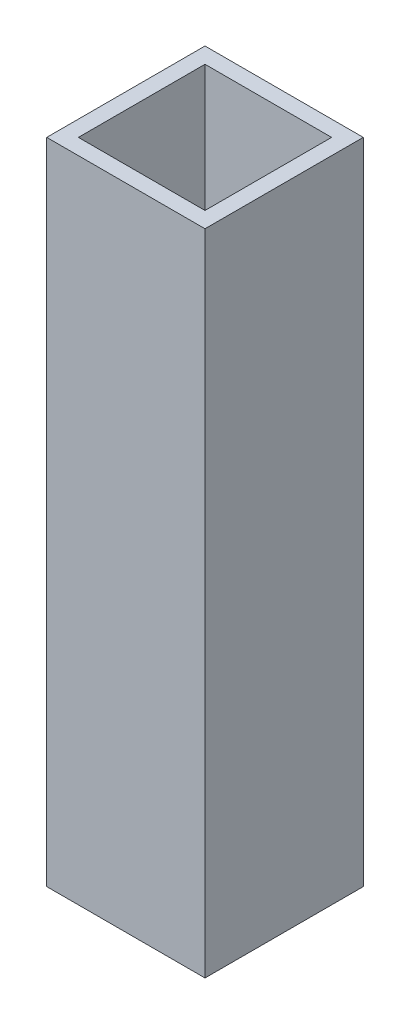
ISO-10303-21;
HEADER;
FILE_DESCRIPTION(('STEP AP214'),'2;1');
FILE_NAME('part.step','',(''),(''),'','','');
FILE_SCHEMA(('AUTOMOTIVE_DESIGN { 1 0 10303 214 1 1 1 1 }'));
ENDSEC;
DATA;
#1=APPLICATION_CONTEXT('core data for automotive mechanical design processes');
#2=APPLICATION_PROTOCOL_DEFINITION('international standard','automotive_design',2000,#1);
#3=PRODUCT_CONTEXT('',#1,'mechanical');
#4=PRODUCT('Part','Part','',(#3));
#5=PRODUCT_RELATED_PRODUCT_CATEGORY('part','',(#4));
#6=PRODUCT_DEFINITION_FORMATION('','',#4);
#7=PRODUCT_DEFINITION_CONTEXT('part definition',#1,'design');
#8=PRODUCT_DEFINITION('design','',#6,#7);
#9=PRODUCT_DEFINITION_SHAPE('','',#8);
#10=(LENGTH_UNIT() NAMED_UNIT(*) SI_UNIT(.MILLI.,.METRE.));
#11=(NAMED_UNIT(*) PLANE_ANGLE_UNIT() SI_UNIT($,.RADIAN.));
#12=(NAMED_UNIT(*) SI_UNIT($,.STERADIAN.) SOLID_ANGLE_UNIT());
#13=UNCERTAINTY_MEASURE_WITH_UNIT(LENGTH_MEASURE(1.E-05),#10,'distance_accuracy_value','');
#14=(GEOMETRIC_REPRESENTATION_CONTEXT(3) GLOBAL_UNCERTAINTY_ASSIGNED_CONTEXT((#13)) GLOBAL_UNIT_ASSIGNED_CONTEXT((#10,
#11,#12)) REPRESENTATION_CONTEXT('',''));
#15=CARTESIAN_POINT('',(0.,0.,0.));
#16=DIRECTION('',(0.,0.,1.));
#17=DIRECTION('',(1.,0.,0.));
#18=AXIS2_PLACEMENT_3D('',#15,#16,#17);
#19=CARTESIAN_POINT('',(0.,205.,0.));
#20=DIRECTION('',(0.,1.,0.));
#21=DIRECTION('',(0.,0.,1.));
#22=AXIS2_PLACEMENT_3D('',#19,#20,#21);
#23=PLANE('',#22);
#24=DIRECTION('',(0.,0.,1.));
#25=VECTOR('',#24,1.);
#26=CARTESIAN_POINT('',(-25.,205.,-25.));
#27=LINE('',#26,#25);
#28=CARTESIAN_POINT('',(-25.,205.,-25.));
#29=VERTEX_POINT('',#28);
#30=CARTESIAN_POINT('',(-25.,205.,25.));
#31=VERTEX_POINT('',#30);
#32=EDGE_CURVE('E153',#29,#31,#27,.T.);
#33=ORIENTED_EDGE('',*,*,#32,.T.);
#34=DIRECTION('',(1.,0.,0.));
#35=VECTOR('',#34,1.);
#36=CARTESIAN_POINT('',(-25.,205.,25.));
#37=LINE('',#36,#35);
#38=CARTESIAN_POINT('',(25.,205.,25.));
#39=VERTEX_POINT('',#38);
#40=EDGE_CURVE('E157',#31,#39,#37,.T.);
#41=ORIENTED_EDGE('',*,*,#40,.T.);
#42=DIRECTION('',(0.,0.,-1.));
#43=VECTOR('',#42,1.);
#44=CARTESIAN_POINT('',(25.,205.,-25.));
#45=LINE('',#44,#43);
#46=CARTESIAN_POINT('',(25.,205.,-25.));
#47=VERTEX_POINT('',#46);
#48=EDGE_CURVE('E161',#39,#47,#45,.T.);
#49=ORIENTED_EDGE('',*,*,#48,.T.);
#50=DIRECTION('',(-1.,0.,0.));
#51=VECTOR('',#50,1.);
#52=CARTESIAN_POINT('',(-25.,205.,-25.));
#53=LINE('',#52,#51);
#54=EDGE_CURVE('E164',#47,#29,#53,.T.);
#55=ORIENTED_EDGE('',*,*,#54,.T.);
#56=EDGE_LOOP('',(#33,#41,#49,#55));
#57=FACE_BOUND('',#56,.T.);
#58=DIRECTION('',(-1.,0.,0.));
#59=VECTOR('',#58,1.);
#60=CARTESIAN_POINT('',(-20.,205.,-20.));
#61=LINE('',#60,#59);
#62=CARTESIAN_POINT('',(20.,205.,-20.));
#63=VERTEX_POINT('',#62);
#64=CARTESIAN_POINT('',(-20.,205.,-20.));
#65=VERTEX_POINT('',#64);
#66=EDGE_CURVE('E114',#63,#65,#61,.T.);
#67=ORIENTED_EDGE('',*,*,#66,.F.);
#68=DIRECTION('',(0.,0.,-1.));
#69=VECTOR('',#68,1.);
#70=CARTESIAN_POINT('',(20.,205.,-20.));
#71=LINE('',#70,#69);
#72=CARTESIAN_POINT('',(20.,205.,20.));
#73=VERTEX_POINT('',#72);
#74=EDGE_CURVE('E105',#73,#63,#71,.T.);
#75=ORIENTED_EDGE('',*,*,#74,.F.);
#76=DIRECTION('',(1.,0.,0.));
#77=VECTOR('',#76,1.);
#78=CARTESIAN_POINT('',(-20.,205.,20.));
#79=LINE('',#78,#77);
#80=CARTESIAN_POINT('',(-20.,205.,20.));
#81=VERTEX_POINT('',#80);
#82=EDGE_CURVE('E131',#81,#73,#79,.T.);
#83=ORIENTED_EDGE('',*,*,#82,.F.);
#84=DIRECTION('',(0.,0.,1.));
#85=VECTOR('',#84,1.);
#86=CARTESIAN_POINT('',(-20.,205.,-20.));
#87=LINE('',#86,#85);
#88=EDGE_CURVE('E127',#65,#81,#87,.T.);
#89=ORIENTED_EDGE('',*,*,#88,.F.);
#90=EDGE_LOOP('',(#67,#75,#83,#89));
#91=FACE_BOUND('',#90,.T.);
#92=ADVANCED_FACE('F39',(#57,#91),#23,.T.);
#93=CARTESIAN_POINT('',(0.,0.,0.));
#94=DIRECTION('',(0.,1.,0.));
#95=DIRECTION('',(0.,0.,1.));
#96=AXIS2_PLACEMENT_3D('',#93,#94,#95);
#97=PLANE('',#96);
#98=DIRECTION('',(0.,0.,1.));
#99=VECTOR('',#98,1.);
#100=CARTESIAN_POINT('',(-25.,0.,-25.));
#101=LINE('',#100,#99);
#102=CARTESIAN_POINT('',(-25.,0.,-25.));
#103=VERTEX_POINT('',#102);
#104=CARTESIAN_POINT('',(-25.,0.,25.));
#105=VERTEX_POINT('',#104);
#106=EDGE_CURVE('E123',#103,#105,#101,.T.);
#107=ORIENTED_EDGE('',*,*,#106,.F.);
#108=DIRECTION('',(-1.,0.,0.));
#109=VECTOR('',#108,1.);
#110=CARTESIAN_POINT('',(-25.,0.,-25.));
#111=LINE('',#110,#109);
#112=CARTESIAN_POINT('',(25.,0.,-25.));
#113=VERTEX_POINT('',#112);
#114=EDGE_CURVE('E158',#113,#103,#111,.T.);
#115=ORIENTED_EDGE('',*,*,#114,.F.);
#116=DIRECTION('',(0.,0.,-1.));
#117=VECTOR('',#116,1.);
#118=CARTESIAN_POINT('',(25.,0.,-25.));
#119=LINE('',#118,#117);
#120=CARTESIAN_POINT('',(25.,0.,25.));
#121=VERTEX_POINT('',#120);
#122=EDGE_CURVE('E174',#121,#113,#119,.T.);
#123=ORIENTED_EDGE('',*,*,#122,.F.);
#124=DIRECTION('',(1.,0.,0.));
#125=VECTOR('',#124,1.);
#126=CARTESIAN_POINT('',(-25.,0.,25.));
#127=LINE('',#126,#125);
#128=EDGE_CURVE('E171',#105,#121,#127,.T.);
#129=ORIENTED_EDGE('',*,*,#128,.F.);
#130=EDGE_LOOP('',(#107,#115,#123,#129));
#131=FACE_BOUND('',#130,.T.);
#132=DIRECTION('',(0.,0.,-1.));
#133=VECTOR('',#132,1.);
#134=CARTESIAN_POINT('',(20.,0.,-20.));
#135=LINE('',#134,#133);
#136=CARTESIAN_POINT('',(20.,0.,20.));
#137=VERTEX_POINT('',#136);
#138=CARTESIAN_POINT('',(20.,0.,-20.));
#139=VERTEX_POINT('',#138);
#140=EDGE_CURVE('E63',#137,#139,#135,.T.);
#141=ORIENTED_EDGE('',*,*,#140,.T.);
#142=DIRECTION('',(-1.,0.,0.));
#143=VECTOR('',#142,1.);
#144=CARTESIAN_POINT('',(-20.,0.,-20.));
#145=LINE('',#144,#143);
#146=CARTESIAN_POINT('',(-20.,0.,-20.));
#147=VERTEX_POINT('',#146);
#148=EDGE_CURVE('E121',#139,#147,#145,.T.);
#149=ORIENTED_EDGE('',*,*,#148,.T.);
#150=DIRECTION('',(0.,0.,1.));
#151=VECTOR('',#150,1.);
#152=CARTESIAN_POINT('',(-20.,0.,-20.));
#153=LINE('',#152,#151);
#154=CARTESIAN_POINT('',(-20.,0.,20.));
#155=VERTEX_POINT('',#154);
#156=EDGE_CURVE('E140',#147,#155,#153,.T.);
#157=ORIENTED_EDGE('',*,*,#156,.T.);
#158=DIRECTION('',(1.,0.,0.));
#159=VECTOR('',#158,1.);
#160=CARTESIAN_POINT('',(-20.,0.,20.));
#161=LINE('',#160,#159);
#162=EDGE_CURVE('E115',#155,#137,#161,.T.);
#163=ORIENTED_EDGE('',*,*,#162,.T.);
#164=EDGE_LOOP('',(#141,#149,#157,#163));
#165=FACE_BOUND('',#164,.T.);
#166=ADVANCED_FACE('F197',(#131,#165),#97,.F.);
#167=CARTESIAN_POINT('',(-25.,205.,-25.));
#168=DIRECTION('',(1.,0.,0.));
#169=DIRECTION('',(0.,0.,-1.));
#170=AXIS2_PLACEMENT_3D('',#167,#168,#169);
#171=PLANE('',#170);
#172=ORIENTED_EDGE('',*,*,#106,.T.);
#173=DIRECTION('',(0.,-1.,0.));
#174=VECTOR('',#173,1.);
#175=CARTESIAN_POINT('',(-25.,205.,25.));
#176=LINE('',#175,#174);
#177=EDGE_CURVE('E11',#31,#105,#176,.T.);
#178=ORIENTED_EDGE('',*,*,#177,.F.);
#179=ORIENTED_EDGE('',*,*,#32,.F.);
#180=DIRECTION('',(0.,-1.,0.));
#181=VECTOR('',#180,1.);
#182=CARTESIAN_POINT('',(-25.,205.,-25.));
#183=LINE('',#182,#181);
#184=EDGE_CURVE('E167',#29,#103,#183,.T.);
#185=ORIENTED_EDGE('',*,*,#184,.T.);
#186=EDGE_LOOP('',(#172,#178,#179,#185));
#187=FACE_BOUND('',#186,.T.);
#188=ADVANCED_FACE('F41',(#187),#171,.F.);
#189=CARTESIAN_POINT('',(-25.,205.,25.));
#190=DIRECTION('',(0.,0.,-1.));
#191=DIRECTION('',(-1.,0.,0.));
#192=AXIS2_PLACEMENT_3D('',#189,#190,#191);
#193=PLANE('',#192);
#194=ORIENTED_EDGE('',*,*,#128,.T.);
#195=DIRECTION('',(0.,-1.,0.));
#196=VECTOR('',#195,1.);
#197=CARTESIAN_POINT('',(25.,205.,25.));
#198=LINE('',#197,#196);
#199=EDGE_CURVE('E48',#39,#121,#198,.T.);
#200=ORIENTED_EDGE('',*,*,#199,.F.);
#201=ORIENTED_EDGE('',*,*,#40,.F.);
#202=ORIENTED_EDGE('',*,*,#177,.T.);
#203=EDGE_LOOP('',(#194,#200,#201,#202));
#204=FACE_BOUND('',#203,.T.);
#205=ADVANCED_FACE('F207',(#204),#193,.F.);
#206=CARTESIAN_POINT('',(25.,205.,-25.));
#207=DIRECTION('',(-1.,0.,0.));
#208=DIRECTION('',(0.,0.,1.));
#209=AXIS2_PLACEMENT_3D('',#206,#207,#208);
#210=PLANE('',#209);
#211=ORIENTED_EDGE('',*,*,#122,.T.);
#212=DIRECTION('',(0.,-1.,0.));
#213=VECTOR('',#212,1.);
#214=CARTESIAN_POINT('',(25.,205.,-25.));
#215=LINE('',#214,#213);
#216=EDGE_CURVE('E182',#47,#113,#215,.T.);
#217=ORIENTED_EDGE('',*,*,#216,.F.);
#218=ORIENTED_EDGE('',*,*,#48,.F.);
#219=ORIENTED_EDGE('',*,*,#199,.T.);
#220=EDGE_LOOP('',(#211,#217,#218,#219));
#221=FACE_BOUND('',#220,.T.);
#222=ADVANCED_FACE('F191',(#221),#210,.F.);
#223=CARTESIAN_POINT('',(-25.,205.,-25.));
#224=DIRECTION('',(0.,0.,1.));
#225=DIRECTION('',(1.,0.,0.));
#226=AXIS2_PLACEMENT_3D('',#223,#224,#225);
#227=PLANE('',#226);
#228=ORIENTED_EDGE('',*,*,#114,.T.);
#229=ORIENTED_EDGE('',*,*,#184,.F.);
#230=ORIENTED_EDGE('',*,*,#54,.F.);
#231=ORIENTED_EDGE('',*,*,#216,.T.);
#232=EDGE_LOOP('',(#228,#229,#230,#231));
#233=FACE_BOUND('',#232,.T.);
#234=ADVANCED_FACE('F201',(#233),#227,.F.);
#235=CARTESIAN_POINT('',(20.,205.,-20.));
#236=DIRECTION('',(-1.,0.,0.));
#237=DIRECTION('',(0.,0.,1.));
#238=AXIS2_PLACEMENT_3D('',#235,#236,#237);
#239=PLANE('',#238);
#240=ORIENTED_EDGE('',*,*,#140,.F.);
#241=DIRECTION('',(0.,-1.,0.));
#242=VECTOR('',#241,1.);
#243=CARTESIAN_POINT('',(20.,205.,20.));
#244=LINE('',#243,#242);
#245=EDGE_CURVE('E109',#73,#137,#244,.T.);
#246=ORIENTED_EDGE('',*,*,#245,.F.);
#247=ORIENTED_EDGE('',*,*,#74,.T.);
#248=DIRECTION('',(0.,-1.,0.));
#249=VECTOR('',#248,1.);
#250=CARTESIAN_POINT('',(20.,205.,-20.));
#251=LINE('',#250,#249);
#252=EDGE_CURVE('E108',#63,#139,#251,.T.);
#253=ORIENTED_EDGE('',*,*,#252,.T.);
#254=EDGE_LOOP('',(#240,#246,#247,#253));
#255=FACE_BOUND('',#254,.T.);
#256=ADVANCED_FACE('F107',(#255),#239,.T.);
#257=CARTESIAN_POINT('',(-20.,205.,-20.));
#258=DIRECTION('',(0.,0.,1.));
#259=DIRECTION('',(1.,0.,0.));
#260=AXIS2_PLACEMENT_3D('',#257,#258,#259);
#261=PLANE('',#260);
#262=ORIENTED_EDGE('',*,*,#148,.F.);
#263=ORIENTED_EDGE('',*,*,#252,.F.);
#264=ORIENTED_EDGE('',*,*,#66,.T.);
#265=DIRECTION('',(0.,-1.,0.));
#266=VECTOR('',#265,1.);
#267=CARTESIAN_POINT('',(-20.,205.,-20.));
#268=LINE('',#267,#266);
#269=EDGE_CURVE('E124',#65,#147,#268,.T.);
#270=ORIENTED_EDGE('',*,*,#269,.T.);
#271=EDGE_LOOP('',(#262,#263,#264,#270));
#272=FACE_BOUND('',#271,.T.);
#273=ADVANCED_FACE('F118',(#272),#261,.T.);
#274=CARTESIAN_POINT('',(-20.,205.,-20.));
#275=DIRECTION('',(1.,0.,0.));
#276=DIRECTION('',(0.,0.,-1.));
#277=AXIS2_PLACEMENT_3D('',#274,#275,#276);
#278=PLANE('',#277);
#279=ORIENTED_EDGE('',*,*,#156,.F.);
#280=ORIENTED_EDGE('',*,*,#269,.F.);
#281=ORIENTED_EDGE('',*,*,#88,.T.);
#282=DIRECTION('',(0.,-1.,0.));
#283=VECTOR('',#282,1.);
#284=CARTESIAN_POINT('',(-20.,205.,20.));
#285=LINE('',#284,#283);
#286=EDGE_CURVE('E55',#81,#155,#285,.T.);
#287=ORIENTED_EDGE('',*,*,#286,.T.);
#288=EDGE_LOOP('',(#279,#280,#281,#287));
#289=FACE_BOUND('',#288,.T.);
#290=ADVANCED_FACE('F230',(#289),#278,.T.);
#291=CARTESIAN_POINT('',(-20.,205.,20.));
#292=DIRECTION('',(0.,0.,-1.));
#293=DIRECTION('',(-1.,0.,0.));
#294=AXIS2_PLACEMENT_3D('',#291,#292,#293);
#295=PLANE('',#294);
#296=ORIENTED_EDGE('',*,*,#162,.F.);
#297=ORIENTED_EDGE('',*,*,#286,.F.);
#298=ORIENTED_EDGE('',*,*,#82,.T.);
#299=ORIENTED_EDGE('',*,*,#245,.T.);
#300=EDGE_LOOP('',(#296,#297,#298,#299));
#301=FACE_BOUND('',#300,.T.);
#302=ADVANCED_FACE('F234',(#301),#295,.T.);
#303=CLOSED_SHELL('',(#92,#166,#188,#205,#222,#234,#256,#273,#290,#302));
#304=MANIFOLD_SOLID_BREP('B2',#303);
#305=ADVANCED_BREP_SHAPE_REPRESENTATION('',(#18,#304),#14);
#306=SHAPE_DEFINITION_REPRESENTATION(#9,#305);
ENDSEC;
END-ISO-10303-21;
